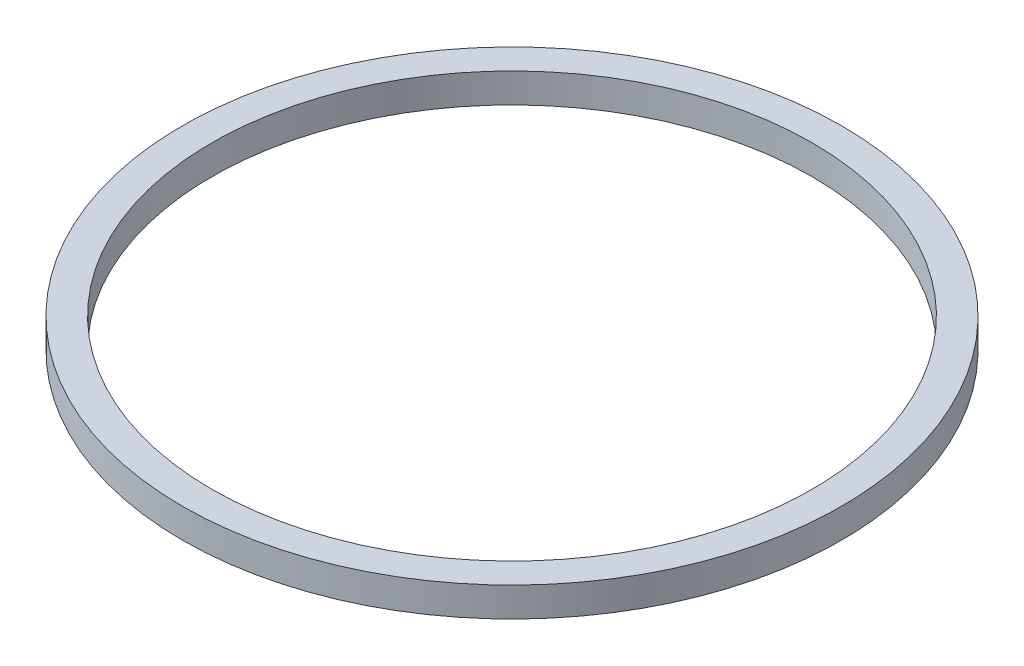
ISO-10303-21;
HEADER;
FILE_DESCRIPTION(('STEP AP214'),'2;1');
FILE_NAME('part.step','',(''),(''),'','','');
FILE_SCHEMA(('AUTOMOTIVE_DESIGN { 1 0 10303 214 1 1 1 1 }'));
ENDSEC;
DATA;
#1=APPLICATION_CONTEXT('core data for automotive mechanical design processes');
#2=APPLICATION_PROTOCOL_DEFINITION('international standard','automotive_design',2000,#1);
#3=PRODUCT_CONTEXT('',#1,'mechanical');
#4=PRODUCT('Part','Part','',(#3));
#5=PRODUCT_RELATED_PRODUCT_CATEGORY('part','',(#4));
#6=PRODUCT_DEFINITION_FORMATION('','',#4);
#7=PRODUCT_DEFINITION_CONTEXT('part definition',#1,'design');
#8=PRODUCT_DEFINITION('design','',#6,#7);
#9=PRODUCT_DEFINITION_SHAPE('','',#8);
#10=(LENGTH_UNIT() NAMED_UNIT(*) SI_UNIT(.MILLI.,.METRE.));
#11=(NAMED_UNIT(*) PLANE_ANGLE_UNIT() SI_UNIT($,.RADIAN.));
#12=(NAMED_UNIT(*) SI_UNIT($,.STERADIAN.) SOLID_ANGLE_UNIT());
#13=UNCERTAINTY_MEASURE_WITH_UNIT(LENGTH_MEASURE(1.E-05),#10,'distance_accuracy_value','');
#14=(GEOMETRIC_REPRESENTATION_CONTEXT(3) GLOBAL_UNCERTAINTY_ASSIGNED_CONTEXT((#13)) GLOBAL_UNIT_ASSIGNED_CONTEXT((#10,
#11,#12)) REPRESENTATION_CONTEXT('',''));
#15=CARTESIAN_POINT('',(0.,0.,0.));
#16=DIRECTION('',(0.,0.,1.));
#17=DIRECTION('',(1.,0.,0.));
#18=AXIS2_PLACEMENT_3D('',#15,#16,#17);
#19=CARTESIAN_POINT('',(25.5,0.,0.));
#20=DIRECTION('',(0.,1.,0.));
#21=DIRECTION('',(0.,0.,1.));
#22=AXIS2_PLACEMENT_3D('',#19,#20,#21);
#23=PLANE('',#22);
#24=CARTESIAN_POINT('',(0.,0.,0.));
#25=DIRECTION('',(0.,1.,0.));
#26=DIRECTION('',(0.,0.,1.));
#27=AXIS2_PLACEMENT_3D('',#24,#25,#26);
#28=CIRCLE('',#27,28.);
#29=CARTESIAN_POINT('',(0.,0.,28.));
#30=VERTEX_POINT('',#29);
#31=EDGE_CURVE('E10',#30,#30,#28,.T.);
#32=ORIENTED_EDGE('',*,*,#31,.F.);
#33=EDGE_LOOP('',(#32));
#34=FACE_BOUND('',#33,.T.);
#35=CARTESIAN_POINT('',(0.,0.,0.));
#36=DIRECTION('',(0.,1.,0.));
#37=DIRECTION('',(0.,0.,1.));
#38=AXIS2_PLACEMENT_3D('',#35,#36,#37);
#39=CIRCLE('',#38,25.5);
#40=CARTESIAN_POINT('',(0.,0.,25.5));
#41=VERTEX_POINT('',#40);
#42=EDGE_CURVE('E50',#41,#41,#39,.T.);
#43=ORIENTED_EDGE('',*,*,#42,.T.);
#44=EDGE_LOOP('',(#43));
#45=FACE_BOUND('',#44,.T.);
#46=ADVANCED_FACE('F36',(#34,#45),#23,.F.);
#47=CARTESIAN_POINT('',(0.,77.1441422656178,0.));
#48=DIRECTION('',(0.,1.,0.));
#49=DIRECTION('',(0.,0.,1.));
#50=AXIS2_PLACEMENT_3D('',#47,#48,#49);
#51=CYLINDRICAL_SURFACE('',#50,28.);
#52=CARTESIAN_POINT('',(0.,2.5,0.));
#53=DIRECTION('',(0.,1.,0.));
#54=DIRECTION('',(0.,0.,1.));
#55=AXIS2_PLACEMENT_3D('',#52,#53,#54);
#56=CIRCLE('',#55,28.);
#57=CARTESIAN_POINT('',(0.,2.5,28.));
#58=VERTEX_POINT('',#57);
#59=EDGE_CURVE('E42',#58,#58,#56,.T.);
#60=ORIENTED_EDGE('',*,*,#59,.F.);
#61=EDGE_LOOP('',(#60));
#62=FACE_BOUND('',#61,.T.);
#63=ORIENTED_EDGE('',*,*,#31,.T.);
#64=EDGE_LOOP('',(#63));
#65=FACE_BOUND('',#64,.T.);
#66=ADVANCED_FACE('F65',(#62,#65),#51,.T.);
#67=CARTESIAN_POINT('',(25.5,2.5,0.));
#68=DIRECTION('',(0.,-1.,0.));
#69=DIRECTION('',(0.,0.,-1.));
#70=AXIS2_PLACEMENT_3D('',#67,#68,#69);
#71=PLANE('',#70);
#72=CARTESIAN_POINT('',(0.,2.5,0.));
#73=DIRECTION('',(0.,1.,0.));
#74=DIRECTION('',(0.,0.,1.));
#75=AXIS2_PLACEMENT_3D('',#72,#73,#74);
#76=CIRCLE('',#75,25.5);
#77=CARTESIAN_POINT('',(0.,2.5,25.5));
#78=VERTEX_POINT('',#77);
#79=EDGE_CURVE('E46',#78,#78,#76,.T.);
#80=ORIENTED_EDGE('',*,*,#79,.F.);
#81=EDGE_LOOP('',(#80));
#82=FACE_BOUND('',#81,.T.);
#83=ORIENTED_EDGE('',*,*,#59,.T.);
#84=EDGE_LOOP('',(#83));
#85=FACE_BOUND('',#84,.T.);
#86=ADVANCED_FACE('F60',(#82,#85),#71,.F.);
#87=CARTESIAN_POINT('',(0.,77.1441422656178,0.));
#88=DIRECTION('',(0.,1.,0.));
#89=DIRECTION('',(0.,0.,1.));
#90=AXIS2_PLACEMENT_3D('',#87,#88,#89);
#91=CYLINDRICAL_SURFACE('',#90,25.5);
#92=ORIENTED_EDGE('',*,*,#42,.F.);
#93=EDGE_LOOP('',(#92));
#94=FACE_BOUND('',#93,.T.);
#95=ORIENTED_EDGE('',*,*,#79,.T.);
#96=EDGE_LOOP('',(#95));
#97=FACE_BOUND('',#96,.T.);
#98=ADVANCED_FACE('F57',(#94,#97),#91,.F.);
#99=CLOSED_SHELL('',(#46,#66,#86,#98));
#100=MANIFOLD_SOLID_BREP('B2',#99);
#101=ADVANCED_BREP_SHAPE_REPRESENTATION('',(#18,#100),#14);
#102=SHAPE_DEFINITION_REPRESENTATION(#9,#101);
ENDSEC;
END-ISO-10303-21;
